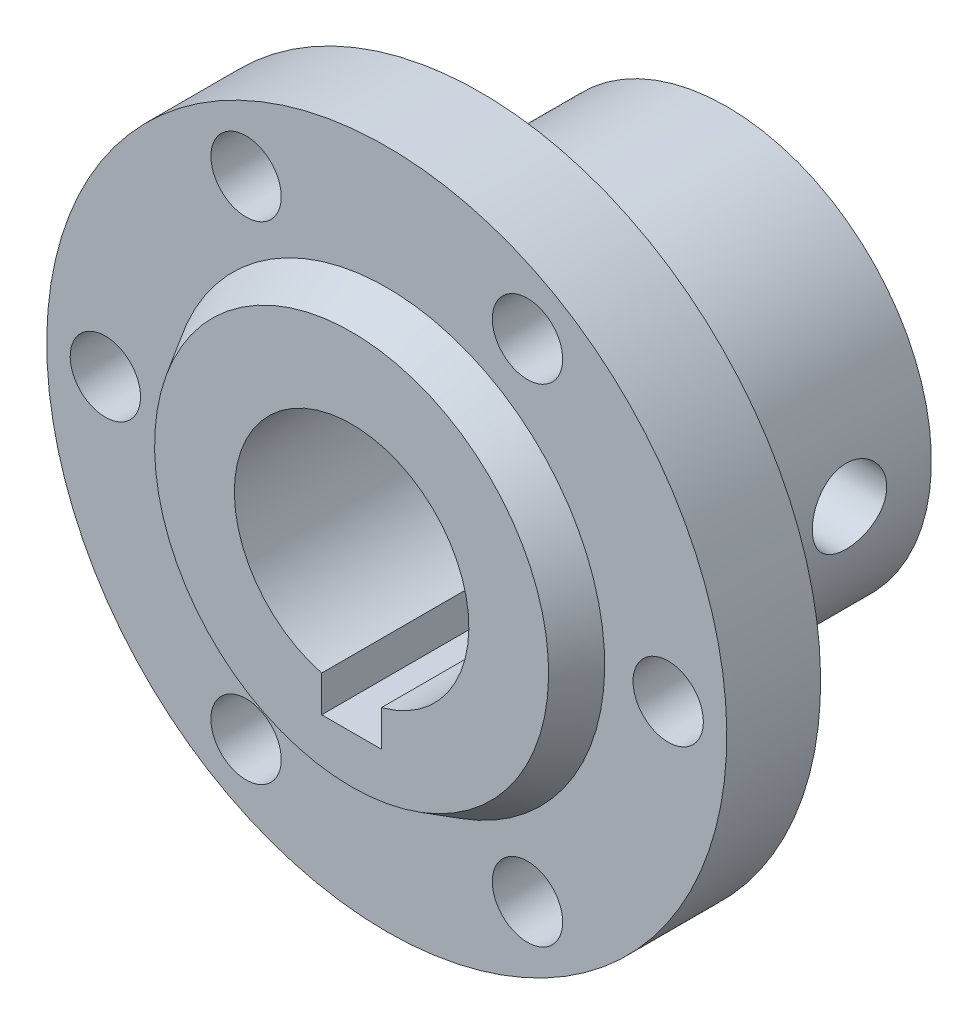
ISO-10303-21;
HEADER;
FILE_DESCRIPTION(('STEP AP214'),'2;1');
FILE_NAME('part.step','',(''),(''),'','','');
FILE_SCHEMA(('AUTOMOTIVE_DESIGN { 1 0 10303 214 1 1 1 1 }'));
ENDSEC;
DATA;
#1=APPLICATION_CONTEXT('core data for automotive mechanical design processes');
#2=APPLICATION_PROTOCOL_DEFINITION('international standard','automotive_design',2000,#1);
#3=PRODUCT_CONTEXT('',#1,'mechanical');
#4=PRODUCT('Part','Part','',(#3));
#5=PRODUCT_RELATED_PRODUCT_CATEGORY('part','',(#4));
#6=PRODUCT_DEFINITION_FORMATION('','',#4);
#7=PRODUCT_DEFINITION_CONTEXT('part definition',#1,'design');
#8=PRODUCT_DEFINITION('design','',#6,#7);
#9=PRODUCT_DEFINITION_SHAPE('','',#8);
#10=(LENGTH_UNIT() NAMED_UNIT(*) SI_UNIT(.MILLI.,.METRE.));
#11=(NAMED_UNIT(*) PLANE_ANGLE_UNIT() SI_UNIT($,.RADIAN.));
#12=(NAMED_UNIT(*) SI_UNIT($,.STERADIAN.) SOLID_ANGLE_UNIT());
#13=UNCERTAINTY_MEASURE_WITH_UNIT(LENGTH_MEASURE(1.E-05),#10,'distance_accuracy_value','');
#14=(GEOMETRIC_REPRESENTATION_CONTEXT(3) GLOBAL_UNCERTAINTY_ASSIGNED_CONTEXT((#13)) GLOBAL_UNIT_ASSIGNED_CONTEXT((#10,
#11,#12)) REPRESENTATION_CONTEXT('',''));
#15=CARTESIAN_POINT('',(0.,0.,0.));
#16=DIRECTION('',(0.,0.,1.));
#17=DIRECTION('',(1.,0.,0.));
#18=AXIS2_PLACEMENT_3D('',#15,#16,#17);
#19=CARTESIAN_POINT('',(0.,10.,-21.));
#20=DIRECTION('',(0.,0.,1.));
#21=DIRECTION('',(0.,-1.,0.));
#22=AXIS2_PLACEMENT_3D('',#19,#20,#21);
#23=PLANE('',#22);
#24=CARTESIAN_POINT('',(0.,0.,-21.));
#25=DIRECTION('',(0.,0.,1.));
#26=DIRECTION('',(0.,-1.,0.));
#27=AXIS2_PLACEMENT_3D('',#24,#25,#26);
#28=CIRCLE('',#27,17.45);
#29=CARTESIAN_POINT('',(0.,-17.45,-21.));
#30=VERTEX_POINT('',#29);
#31=EDGE_CURVE('E11',#30,#30,#28,.T.);
#32=ORIENTED_EDGE('',*,*,#31,.F.);
#33=EDGE_LOOP('',(#32));
#34=FACE_BOUND('',#33,.T.);
#35=DIRECTION('',(1.,0.,0.));
#36=VECTOR('',#35,1.);
#37=CARTESIAN_POINT('',(-2.55,-12.75,-21.));
#38=LINE('',#37,#36);
#39=CARTESIAN_POINT('',(-2.55,-12.75,-21.));
#40=VERTEX_POINT('',#39);
#41=CARTESIAN_POINT('',(2.55,-12.75,-21.));
#42=VERTEX_POINT('',#41);
#43=EDGE_CURVE('E230',#40,#42,#38,.T.);
#44=ORIENTED_EDGE('',*,*,#43,.T.);
#45=DIRECTION('',(0.,1.,0.));
#46=VECTOR('',#45,1.);
#47=CARTESIAN_POINT('',(2.55,-12.75,-21.));
#48=LINE('',#47,#46);
#49=CARTESIAN_POINT('',(2.55,-9.66941053012023,-21.));
#50=VERTEX_POINT('',#49);
#51=EDGE_CURVE('E95',#42,#50,#48,.T.);
#52=ORIENTED_EDGE('',*,*,#51,.T.);
#53=CARTESIAN_POINT('',(0.,0.,-21.));
#54=DIRECTION('',(0.,0.,1.));
#55=DIRECTION('',(0.,-1.,0.));
#56=AXIS2_PLACEMENT_3D('',#53,#54,#55);
#57=CIRCLE('',#56,10.);
#58=CARTESIAN_POINT('',(-2.55,-9.66941053012023,-21.));
#59=VERTEX_POINT('',#58);
#60=EDGE_CURVE('E109',#50,#59,#57,.T.);
#61=ORIENTED_EDGE('',*,*,#60,.T.);
#62=DIRECTION('',(0.,-1.,0.));
#63=VECTOR('',#62,1.);
#64=CARTESIAN_POINT('',(-2.55,-12.75,-21.));
#65=LINE('',#64,#63);
#66=EDGE_CURVE('E60',#59,#40,#65,.T.);
#67=ORIENTED_EDGE('',*,*,#66,.T.);
#68=EDGE_LOOP('',(#44,#52,#61,#67));
#69=FACE_BOUND('',#68,.T.);
#70=ADVANCED_FACE('F39',(#34,#69),#23,.F.);
#71=CARTESIAN_POINT('',(0.,0.,11.));
#72=DIRECTION('',(0.,0.,1.));
#73=DIRECTION('',(0.,-1.,0.));
#74=AXIS2_PLACEMENT_3D('',#71,#72,#73);
#75=CYLINDRICAL_SURFACE('',#74,17.45);
#76=CARTESIAN_POINT('',(-17.45,0.,-17.19));
#77=CARTESIAN_POINT('',(-17.4499968356423,0.176777458792748,-17.1899931464343));
#78=CARTESIAN_POINT('',(-17.4472859262513,0.35364520049326,-17.1751862053184));
#79=CARTESIAN_POINT('',(-17.4367327930988,0.702403150501791,-17.1163840413017));
#80=CARTESIAN_POINT('',(-17.4288861310247,0.874288919098851,-17.0723635716384));
#81=CARTESIAN_POINT('',(-17.4089398967288,1.20798811917376,-16.9565215224765));
#82=CARTESIAN_POINT('',(-17.3968440664669,1.36981026590932,-16.8847243984128));
#83=CARTESIAN_POINT('',(-17.3697228684474,1.67909503843731,-16.7154350646426));
#84=CARTESIAN_POINT('',(-17.3546977647874,1.82655895694355,-16.6179451710672));
#85=CARTESIAN_POINT('',(-17.3231884644956,2.10462524815861,-16.3988668251295));
#86=CARTESIAN_POINT('',(-17.3066910335339,2.23504175764802,-16.2770443437794));
#87=CARTESIAN_POINT('',(-17.2741955082971,2.47370393586634,-16.0132624520033));
#88=CARTESIAN_POINT('',(-17.2581974487005,2.58194806774579,-15.8713016468691));
#89=CARTESIAN_POINT('',(-17.2283835601209,2.7739581441263,-15.5699694243305));
#90=CARTESIAN_POINT('',(-17.2145848068104,2.85753647155956,-15.4104766187937));
#91=CARTESIAN_POINT('',(-17.1909176189237,2.99664176919229,-15.0794211690432));
#92=CARTESIAN_POINT('',(-17.1810488660407,3.05217101129911,-14.9078595036604));
#93=CARTESIAN_POINT('',(-17.1664918922464,3.13300834630634,-14.5595201169512));
#94=CARTESIAN_POINT('',(-17.1617482989302,3.15863970284213,-14.382819773011));
#95=CARTESIAN_POINT('',(-17.1578116456317,3.17995677493461,-14.0275677830454));
#96=CARTESIAN_POINT('',(-17.1586181172308,3.175645017653,-13.8490162945243));
#97=CARTESIAN_POINT('',(-17.1656400178698,3.1374607089361,-13.4974628251121));
#98=CARTESIAN_POINT('',(-17.1717884116802,3.10395450081108,-13.3244195175767));
#99=CARTESIAN_POINT('',(-17.1886961965339,3.00890878421799,-12.9864520815007));
#100=CARTESIAN_POINT('',(-17.1994557731118,2.9473681477562,-12.8215282799527));
#101=CARTESIAN_POINT('',(-17.2244443173296,2.79763858959231,-12.5034026629164));
#102=CARTESIAN_POINT('',(-17.2386926064282,2.70930058220796,-12.3502725966404));
#103=CARTESIAN_POINT('',(-17.2690402067667,2.5085894229184,-12.0608706922427));
#104=CARTESIAN_POINT('',(-17.2851396951733,2.39621396965536,-11.9246004702645));
#105=CARTESIAN_POINT('',(-17.3176684711285,2.14863688732397,-11.6706687162038));
#106=CARTESIAN_POINT('',(-17.3340991101936,2.01312163743453,-11.5533129153884));
#107=CARTESIAN_POINT('',(-17.3652192399338,1.72416428234283,-11.3429560871944));
#108=CARTESIAN_POINT('',(-17.3799087150282,1.57072201674669,-11.2499552777452));
#109=CARTESIAN_POINT('',(-17.4059184967845,1.2499561199525,-11.0909081550799));
#110=CARTESIAN_POINT('',(-17.4172349914246,1.08261705402134,-11.0248923082548));
#111=CARTESIAN_POINT('',(-17.4351940146049,0.738973567082016,-10.9219910883415));
#112=CARTESIAN_POINT('',(-17.4418370102476,0.562670043934365,-10.8851028039935));
#113=CARTESIAN_POINT('',(-17.4496367647488,0.208733888507845,-10.8419262958792));
#114=CARTESIAN_POINT('',(-17.4508686610799,0.0311539853256341,-10.8352189532137));
#115=CARTESIAN_POINT('',(-17.4479144808514,-0.322590449564425,-10.8514723843021));
#116=CARTESIAN_POINT('',(-17.4437286543511,-0.498755046219249,-10.8744317887639));
#117=CARTESIAN_POINT('',(-17.4304560591178,-0.843348466341477,-10.9490184643946));
#118=CARTESIAN_POINT('',(-17.4214053429004,-1.01182442783343,-11.0004349293327));
#119=CARTESIAN_POINT('',(-17.3994135712492,-1.33776493136578,-11.1302490218501));
#120=CARTESIAN_POINT('',(-17.3864722638838,-1.49522875951145,-11.2086483967307));
#121=CARTESIAN_POINT('',(-17.357947493001,-1.79647274188855,-11.3911394037856));
#122=CARTESIAN_POINT('',(-17.3423380528372,-1.94009428345074,-11.4954887211316));
#123=CARTESIAN_POINT('',(-17.3102783837538,-2.20793827608375,-11.7265672394738));
#124=CARTESIAN_POINT('',(-17.2938280812997,-2.33215902666324,-11.8532984001802));
#125=CARTESIAN_POINT('',(-17.2616932015934,-2.55925710014975,-12.1274358611325));
#126=CARTESIAN_POINT('',(-17.2460207208549,-2.66184916434728,-12.2750801228644));
#127=CARTESIAN_POINT('',(-17.2174544192312,-2.84077578169373,-12.5857529986813));
#128=CARTESIAN_POINT('',(-17.2045604989398,-2.91711127425871,-12.7487810620936));
#129=CARTESIAN_POINT('',(-17.1831050058779,-3.04094721478348,-13.0848492555839));
#130=CARTESIAN_POINT('',(-17.1745233533884,-3.08858151797524,-13.2578387207718));
#131=CARTESIAN_POINT('',(-17.162616875861,-3.15407824872835,-13.6095353554068));
#132=CARTESIAN_POINT('',(-17.1592914961203,-3.17194381784172,-13.7882419194885));
#133=CARTESIAN_POINT('',(-17.1583010557209,-3.17729563175429,-14.1434451641146));
#134=CARTESIAN_POINT('',(-17.1605522100864,-3.16523155229777,-14.319934993724));
#135=CARTESIAN_POINT('',(-17.1702760049224,-3.11204764664827,-14.668326900801));
#136=CARTESIAN_POINT('',(-17.1777486184265,-3.07092797051382,-14.8402290019571));
#137=CARTESIAN_POINT('',(-17.1970390158291,-2.96098509209594,-15.1743427087057));
#138=CARTESIAN_POINT('',(-17.2088495914337,-2.89220782992035,-15.3365698740631));
#139=CARTESIAN_POINT('',(-17.2354907323,-2.7289503868357,-15.6472548165606));
#140=CARTESIAN_POINT('',(-17.2503214935714,-2.63446853756776,-15.7957116991001));
#141=CARTESIAN_POINT('',(-17.2815935905806,-2.42090899485702,-16.0768999281954));
#142=CARTESIAN_POINT('',(-17.2980547013253,-2.30150301885964,-16.2093797892677));
#143=CARTESIAN_POINT('',(-17.3305821444212,-2.04217171451801,-16.452573342114));
#144=CARTESIAN_POINT('',(-17.3466483851531,-1.90224167560724,-16.5632820233998));
#145=CARTESIAN_POINT('',(-17.3767337881174,-1.60442792144329,-16.7606551385875));
#146=CARTESIAN_POINT('',(-17.3907346111634,-1.44640320080985,-16.8471096763676));
#147=CARTESIAN_POINT('',(-17.4149329322382,-1.11787195477031,-16.9921065373913));
#148=CARTESIAN_POINT('',(-17.4251340609271,-0.947377531706018,-17.0506755206348));
#149=CARTESIAN_POINT('',(-17.4384628809173,-0.646945957537485,-17.1261171294365));
#150=CARTESIAN_POINT('',(-17.4427652348522,-0.518783165569404,-17.1500329913935));
#151=CARTESIAN_POINT('',(-17.4485349275157,-0.260429886193315,-17.181976768993));
#152=CARTESIAN_POINT('',(-17.4500023313164,-0.130239445396246,-17.1900050493123));
#153=CARTESIAN_POINT('',(-17.45,0.,-17.19));
#154=B_SPLINE_CURVE_WITH_KNOTS('',3,(#76,#77,#78,#79,#80,#81,#82,#83,#84,#85,#86,#87,#88,#89,
#90,#91,#92,#93,#94,#95,#96,#97,#98,#99,#100,#101,#102,#103,#104,#105,#106,#107,#108,#109,#110,
#111,#112,#113,#114,#115,#116,#117,#118,#119,#120,#121,#122,#123,#124,#125,#126,#127,#128,#129,
#130,#131,#132,#133,#134,#135,#136,#137,#138,#139,#140,#141,#142,#143,#144,#145,#146,#147,#148,
#149,#150,#151,#152,#153),.UNSPECIFIED.,.T.,.F.,(4,2,2,2,2,2,2,2,2,2,2,2,2,2,2,2,2,2,2,2,2,2,2,
2,2,2,2,2,2,2,2,2,2,2,2,2,2,2,4),(0.,0.529856147897096,1.06017080264573,1.59001961046401,
2.11982067022852,2.65498657198904,3.19018955553412,3.7293643481414,4.2684954619029,
4.80174167350453,5.33494288033355,5.86154809141934,6.38817449287283,6.91778622411281,
7.44744868337449,7.98496123437811,8.52247859490127,9.06060115475076,9.59866992317804,
10.1292430654468,10.6597917195671,11.186461747219,11.7131658862526,12.2453251036395,
12.7775309389651,13.3163688022479,13.8551873848102,14.3914731986041,14.9277024135346,
15.4559240238528,15.9841429061742,16.5114880009291,17.0388673312407,17.5736890849395,
18.1086337805306,18.6480743417554,19.1869981297487,19.5773745688751,19.9677420473601),.UNSPECIFIED.);
#155=CARTESIAN_POINT('',(-17.45,0.,-17.19));
#156=VERTEX_POINT('',#155);
#157=EDGE_CURVE('E136',#156,#156,#154,.T.);
#158=ORIENTED_EDGE('',*,*,#157,.T.);
#159=EDGE_LOOP('',(#158));
#160=FACE_BOUND('',#159,.T.);
#161=CARTESIAN_POINT('',(17.45,0.,-17.19));
#162=CARTESIAN_POINT('',(17.4499968356423,-0.176777458792748,-17.1899931464343));
#163=CARTESIAN_POINT('',(17.4472859262513,-0.35364520049326,-17.1751862053184));
#164=CARTESIAN_POINT('',(17.4367327930988,-0.702403150501791,-17.1163840413017));
#165=CARTESIAN_POINT('',(17.4288861310247,-0.874288919098851,-17.0723635716384));
#166=CARTESIAN_POINT('',(17.4089398967288,-1.20798811917376,-16.9565215224765));
#167=CARTESIAN_POINT('',(17.3968440664669,-1.36981026590932,-16.8847243984128));
#168=CARTESIAN_POINT('',(17.3697228684474,-1.67909503843731,-16.7154350646426));
#169=CARTESIAN_POINT('',(17.3546977647874,-1.82655895694355,-16.6179451710672));
#170=CARTESIAN_POINT('',(17.3231884644956,-2.10462524815862,-16.3988668251295));
#171=CARTESIAN_POINT('',(17.3066910335339,-2.23504175764802,-16.2770443437794));
#172=CARTESIAN_POINT('',(17.2741955082971,-2.47370393586634,-16.0132624520033));
#173=CARTESIAN_POINT('',(17.2581974487005,-2.58194806774579,-15.8713016468691));
#174=CARTESIAN_POINT('',(17.2283835601209,-2.7739581441263,-15.5699694243305));
#175=CARTESIAN_POINT('',(17.2145848068104,-2.85753647155956,-15.4104766187937));
#176=CARTESIAN_POINT('',(17.1909176189237,-2.99664176919229,-15.0794211690432));
#177=CARTESIAN_POINT('',(17.1810488660407,-3.05217101129911,-14.9078595036604));
#178=CARTESIAN_POINT('',(17.1664918922464,-3.13300834630634,-14.5595201169512));
#179=CARTESIAN_POINT('',(17.1617482989302,-3.15863970284213,-14.382819773011));
#180=CARTESIAN_POINT('',(17.1578116456317,-3.17995677493461,-14.0275677830454));
#181=CARTESIAN_POINT('',(17.1586181172308,-3.175645017653,-13.8490162945243));
#182=CARTESIAN_POINT('',(17.1656400178698,-3.1374607089361,-13.4974628251121));
#183=CARTESIAN_POINT('',(17.1717884116802,-3.10395450081108,-13.3244195175766));
#184=CARTESIAN_POINT('',(17.1886961965339,-3.00890878421799,-12.9864520815007));
#185=CARTESIAN_POINT('',(17.1994557731118,-2.9473681477562,-12.8215282799527));
#186=CARTESIAN_POINT('',(17.2244443173296,-2.79763858959231,-12.5034026629164));
#187=CARTESIAN_POINT('',(17.2386926064282,-2.70930058220796,-12.3502725966404));
#188=CARTESIAN_POINT('',(17.2690402067667,-2.5085894229184,-12.0608706922427));
#189=CARTESIAN_POINT('',(17.2851396951733,-2.39621396965536,-11.9246004702645));
#190=CARTESIAN_POINT('',(17.3176684711285,-2.14863688732397,-11.6706687162038));
#191=CARTESIAN_POINT('',(17.3340991101936,-2.01312163743453,-11.5533129153884));
#192=CARTESIAN_POINT('',(17.3652192399338,-1.72416428234283,-11.3429560871944));
#193=CARTESIAN_POINT('',(17.3799087150282,-1.57072201674669,-11.2499552777452));
#194=CARTESIAN_POINT('',(17.4059184967845,-1.2499561199525,-11.0909081550799));
#195=CARTESIAN_POINT('',(17.4172349914246,-1.08261705402134,-11.0248923082548));
#196=CARTESIAN_POINT('',(17.4351940146049,-0.738973567082019,-10.9219910883415));
#197=CARTESIAN_POINT('',(17.4418370102476,-0.562670043934368,-10.8851028039935));
#198=CARTESIAN_POINT('',(17.4496367647488,-0.208733888507847,-10.8419262958792));
#199=CARTESIAN_POINT('',(17.4508686610799,-0.0311539853256363,-10.8352189532137));
#200=CARTESIAN_POINT('',(17.4479144808514,0.322590449564423,-10.8514723843021));
#201=CARTESIAN_POINT('',(17.4437286543511,0.498755046219247,-10.8744317887639));
#202=CARTESIAN_POINT('',(17.4304560591178,0.843348466341475,-10.9490184643946));
#203=CARTESIAN_POINT('',(17.4214053429004,1.01182442783343,-11.0004349293327));
#204=CARTESIAN_POINT('',(17.3994135712492,1.33776493136578,-11.1302490218501));
#205=CARTESIAN_POINT('',(17.3864722638838,1.49522875951145,-11.2086483967307));
#206=CARTESIAN_POINT('',(17.357947493001,1.79647274188855,-11.3911394037856));
#207=CARTESIAN_POINT('',(17.3423380528372,1.94009428345074,-11.4954887211316));
#208=CARTESIAN_POINT('',(17.3102783837538,2.20793827608375,-11.7265672394738));
#209=CARTESIAN_POINT('',(17.2938280812997,2.33215902666324,-11.8532984001802));
#210=CARTESIAN_POINT('',(17.2616932015934,2.55925710014975,-12.1274358611325));
#211=CARTESIAN_POINT('',(17.2460207208549,2.66184916434728,-12.2750801228644));
#212=CARTESIAN_POINT('',(17.2174544192312,2.84077578169373,-12.5857529986813));
#213=CARTESIAN_POINT('',(17.2045604989398,2.91711127425872,-12.7487810620936));
#214=CARTESIAN_POINT('',(17.1831050058779,3.04094721478348,-13.0848492555839));
#215=CARTESIAN_POINT('',(17.1745233533884,3.08858151797524,-13.2578387207718));
#216=CARTESIAN_POINT('',(17.162616875861,3.15407824872835,-13.6095353554068));
#217=CARTESIAN_POINT('',(17.1592914961203,3.17194381784172,-13.7882419194885));
#218=CARTESIAN_POINT('',(17.1583010557209,3.17729563175429,-14.1434451641146));
#219=CARTESIAN_POINT('',(17.1605522100864,3.16523155229777,-14.319934993724));
#220=CARTESIAN_POINT('',(17.1702760049224,3.11204764664827,-14.668326900801));
#221=CARTESIAN_POINT('',(17.1777486184265,3.07092797051382,-14.8402290019571));
#222=CARTESIAN_POINT('',(17.1970390158291,2.96098509209594,-15.1743427087057));
#223=CARTESIAN_POINT('',(17.2088495914337,2.89220782992035,-15.3365698740631));
#224=CARTESIAN_POINT('',(17.2354907323,2.7289503868357,-15.6472548165606));
#225=CARTESIAN_POINT('',(17.2503214935714,2.63446853756776,-15.7957116991001));
#226=CARTESIAN_POINT('',(17.2815935905806,2.42090899485702,-16.0768999281954));
#227=CARTESIAN_POINT('',(17.2980547013253,2.30150301885964,-16.2093797892677));
#228=CARTESIAN_POINT('',(17.3305821444212,2.04217171451801,-16.452573342114));
#229=CARTESIAN_POINT('',(17.3466483851531,1.90224167560724,-16.5632820233998));
#230=CARTESIAN_POINT('',(17.3767337881174,1.60442792144329,-16.7606551385875));
#231=CARTESIAN_POINT('',(17.3907346111634,1.44640320080985,-16.8471096763676));
#232=CARTESIAN_POINT('',(17.4149329322382,1.11787195477032,-16.9921065373913));
#233=CARTESIAN_POINT('',(17.4251340609271,0.947377531706022,-17.0506755206347));
#234=CARTESIAN_POINT('',(17.4384628809173,0.646945957537488,-17.1261171294365));
#235=CARTESIAN_POINT('',(17.4427652348522,0.518783165569407,-17.1500329913935));
#236=CARTESIAN_POINT('',(17.4485349275157,0.260429886193316,-17.181976768993));
#237=CARTESIAN_POINT('',(17.4500023313164,0.130239445396246,-17.1900050493123));
#238=CARTESIAN_POINT('',(17.45,0.,-17.19));
#239=B_SPLINE_CURVE_WITH_KNOTS('',3,(#161,#162,#163,#164,#165,#166,#167,#168,#169,#170,#171,
#172,#173,#174,#175,#176,#177,#178,#179,#180,#181,#182,#183,#184,#185,#186,#187,#188,#189,#190,
#191,#192,#193,#194,#195,#196,#197,#198,#199,#200,#201,#202,#203,#204,#205,#206,#207,#208,#209,
#210,#211,#212,#213,#214,#215,#216,#217,#218,#219,#220,#221,#222,#223,#224,#225,#226,#227,#228,
#229,#230,#231,#232,#233,#234,#235,#236,#237,#238),.UNSPECIFIED.,.T.,.F.,(4,2,2,2,2,2,2,2,2,2,2,
2,2,2,2,2,2,2,2,2,2,2,2,2,2,2,2,2,2,2,2,2,2,2,2,2,2,2,4),(0.,0.529856147897096,1.06017080264573,
1.59001961046401,2.11982067022852,2.65498657198904,3.19018955553413,3.7293643481414,
4.26849546190291,4.80174167350453,5.33494288033355,5.86154809141934,6.38817449287283,
6.91778622411281,7.44744868337449,7.9849612343781,8.52247859490127,9.06060115475075,
9.59866992317803,10.1292430654468,10.6597917195671,11.186461747219,11.7131658862526,
12.2453251036395,12.7775309389651,13.3163688022479,13.8551873848102,14.3914731986041,
14.9277024135346,15.4559240238528,15.9841429061742,16.5114880009291,17.0388673312407,
17.5736890849395,18.1086337805306,18.6480743417554,19.1869981297487,19.5773745688751,
19.9677420473601),.UNSPECIFIED.);
#240=CARTESIAN_POINT('',(17.45,0.,-17.19));
#241=VERTEX_POINT('',#240);
#242=EDGE_CURVE('E176',#241,#241,#239,.T.);
#243=ORIENTED_EDGE('',*,*,#242,.T.);
#244=EDGE_LOOP('',(#243));
#245=FACE_BOUND('',#244,.T.);
#246=CARTESIAN_POINT('',(0.,0.,-7.03));
#247=DIRECTION('',(0.,0.,1.));
#248=DIRECTION('',(0.,-1.,0.));
#249=AXIS2_PLACEMENT_3D('',#246,#247,#248);
#250=CIRCLE('',#249,17.45);
#251=CARTESIAN_POINT('',(0.,-17.45,-7.03));
#252=VERTEX_POINT('',#251);
#253=EDGE_CURVE('E52',#252,#252,#250,.T.);
#254=ORIENTED_EDGE('',*,*,#253,.F.);
#255=EDGE_LOOP('',(#254));
#256=FACE_BOUND('',#255,.T.);
#257=ORIENTED_EDGE('',*,*,#31,.T.);
#258=EDGE_LOOP('',(#257));
#259=FACE_BOUND('',#258,.T.);
#260=ADVANCED_FACE('F185',(#160,#245,#256,#259),#75,.T.);
#261=CARTESIAN_POINT('',(0.,17.45,-7.03));
#262=DIRECTION('',(0.,0.,1.));
#263=DIRECTION('',(0.,-1.,0.));
#264=AXIS2_PLACEMENT_3D('',#261,#262,#263);
#265=PLANE('',#264);
#266=CARTESIAN_POINT('',(0.,0.,-7.03));
#267=DIRECTION('',(0.,0.,1.));
#268=DIRECTION('',(0.,-1.,0.));
#269=AXIS2_PLACEMENT_3D('',#266,#267,#268);
#270=CIRCLE('',#269,18.5);
#271=CARTESIAN_POINT('',(0.,-18.5,-7.03));
#272=VERTEX_POINT('',#271);
#273=EDGE_CURVE('E127',#272,#272,#270,.T.);
#274=ORIENTED_EDGE('',*,*,#273,.F.);
#275=EDGE_LOOP('',(#274));
#276=FACE_BOUND('',#275,.T.);
#277=ORIENTED_EDGE('',*,*,#253,.T.);
#278=EDGE_LOOP('',(#277));
#279=FACE_BOUND('',#278,.T.);
#280=ADVANCED_FACE('F189',(#276,#279),#265,.F.);
#281=CARTESIAN_POINT('',(0.,0.,11.));
#282=DIRECTION('',(0.,0.,1.));
#283=DIRECTION('',(0.,-1.,0.));
#284=AXIS2_PLACEMENT_3D('',#281,#282,#283);
#285=CYLINDRICAL_SURFACE('',#284,18.5);
#286=CARTESIAN_POINT('',(0.,0.,0.));
#287=DIRECTION('',(0.,0.,1.));
#288=DIRECTION('',(0.,-1.,0.));
#289=AXIS2_PLACEMENT_3D('',#286,#287,#288);
#290=CIRCLE('',#289,18.5);
#291=CARTESIAN_POINT('',(0.,-18.5,0.));
#292=VERTEX_POINT('',#291);
#293=EDGE_CURVE('E124',#292,#292,#290,.T.);
#294=ORIENTED_EDGE('',*,*,#293,.F.);
#295=EDGE_LOOP('',(#294));
#296=FACE_BOUND('',#295,.T.);
#297=ORIENTED_EDGE('',*,*,#273,.T.);
#298=EDGE_LOOP('',(#297));
#299=FACE_BOUND('',#298,.T.);
#300=ADVANCED_FACE('F194',(#296,#299),#285,.T.);
#301=CARTESIAN_POINT('',(0.,18.5,0.));
#302=DIRECTION('',(0.,0.,1.));
#303=DIRECTION('',(0.,-1.,0.));
#304=AXIS2_PLACEMENT_3D('',#301,#302,#303);
#305=PLANE('',#304);
#306=CARTESIAN_POINT('',(24.,0.,0.));
#307=DIRECTION('',(0.,0.,1.));
#308=DIRECTION('',(0.,-1.,0.));
#309=AXIS2_PLACEMENT_3D('',#306,#307,#308);
#310=CIRCLE('',#309,2.99999999999999);
#311=CARTESIAN_POINT('',(24.,-2.99999999999999,0.));
#312=VERTEX_POINT('',#311);
#313=EDGE_CURVE('E105',#312,#312,#310,.T.);
#314=ORIENTED_EDGE('',*,*,#313,.T.);
#315=EDGE_LOOP('',(#314));
#316=FACE_BOUND('',#315,.T.);
#317=CARTESIAN_POINT('',(12.,-20.7846096908265,0.));
#318=DIRECTION('',(0.,0.,1.));
#319=DIRECTION('',(0.,-1.,0.));
#320=AXIS2_PLACEMENT_3D('',#317,#318,#319);
#321=CIRCLE('',#320,3.00000000000001);
#322=CARTESIAN_POINT('',(12.,-23.7846096908265,0.));
#323=VERTEX_POINT('',#322);
#324=EDGE_CURVE('E152',#323,#323,#321,.T.);
#325=ORIENTED_EDGE('',*,*,#324,.T.);
#326=EDGE_LOOP('',(#325));
#327=FACE_BOUND('',#326,.T.);
#328=CARTESIAN_POINT('',(-12.,-20.7846096908265,0.));
#329=DIRECTION('',(0.,0.,1.));
#330=DIRECTION('',(0.,-1.,0.));
#331=AXIS2_PLACEMENT_3D('',#328,#329,#330);
#332=CIRCLE('',#331,3.00000000000001);
#333=CARTESIAN_POINT('',(-12.,-23.7846096908265,0.));
#334=VERTEX_POINT('',#333);
#335=EDGE_CURVE('E148',#334,#334,#332,.T.);
#336=ORIENTED_EDGE('',*,*,#335,.T.);
#337=EDGE_LOOP('',(#336));
#338=FACE_BOUND('',#337,.T.);
#339=CARTESIAN_POINT('',(-24.,0.,0.));
#340=DIRECTION('',(0.,0.,1.));
#341=DIRECTION('',(0.,-1.,0.));
#342=AXIS2_PLACEMENT_3D('',#339,#340,#341);
#343=CIRCLE('',#342,2.99999999999999);
#344=CARTESIAN_POINT('',(-24.,-2.99999999999999,0.));
#345=VERTEX_POINT('',#344);
#346=EDGE_CURVE('E144',#345,#345,#343,.T.);
#347=ORIENTED_EDGE('',*,*,#346,.T.);
#348=EDGE_LOOP('',(#347));
#349=FACE_BOUND('',#348,.T.);
#350=CARTESIAN_POINT('',(-12.,20.7846096908265,0.));
#351=DIRECTION('',(0.,0.,1.));
#352=DIRECTION('',(0.,-1.,0.));
#353=AXIS2_PLACEMENT_3D('',#350,#351,#352);
#354=CIRCLE('',#353,3.00000000000001);
#355=CARTESIAN_POINT('',(-12.,17.7846096908265,0.));
#356=VERTEX_POINT('',#355);
#357=EDGE_CURVE('E140',#356,#356,#354,.T.);
#358=ORIENTED_EDGE('',*,*,#357,.T.);
#359=EDGE_LOOP('',(#358));
#360=FACE_BOUND('',#359,.T.);
#361=CARTESIAN_POINT('',(12.,20.7846096908265,0.));
#362=DIRECTION('',(0.,0.,1.));
#363=DIRECTION('',(0.,-1.,0.));
#364=AXIS2_PLACEMENT_3D('',#361,#362,#363);
#365=CIRCLE('',#364,3.00000000000001);
#366=CARTESIAN_POINT('',(12.,17.7846096908265,0.));
#367=VERTEX_POINT('',#366);
#368=EDGE_CURVE('E135',#367,#367,#365,.T.);
#369=ORIENTED_EDGE('',*,*,#368,.T.);
#370=EDGE_LOOP('',(#369));
#371=FACE_BOUND('',#370,.T.);
#372=CARTESIAN_POINT('',(0.,0.,0.));
#373=DIRECTION('',(0.,0.,1.));
#374=DIRECTION('',(0.,-1.,0.));
#375=AXIS2_PLACEMENT_3D('',#372,#373,#374);
#376=CIRCLE('',#375,29.);
#377=CARTESIAN_POINT('',(0.,-29.,0.));
#378=VERTEX_POINT('',#377);
#379=EDGE_CURVE('E121',#378,#378,#376,.T.);
#380=ORIENTED_EDGE('',*,*,#379,.F.);
#381=EDGE_LOOP('',(#380));
#382=FACE_BOUND('',#381,.T.);
#383=ORIENTED_EDGE('',*,*,#293,.T.);
#384=EDGE_LOOP('',(#383));
#385=FACE_BOUND('',#384,.T.);
#386=ADVANCED_FACE('F198',(#316,#327,#338,#349,#360,#371,#382,#385),#305,.F.);
#387=CARTESIAN_POINT('',(0.,0.,11.));
#388=DIRECTION('',(0.,0.,1.));
#389=DIRECTION('',(0.,-1.,0.));
#390=AXIS2_PLACEMENT_3D('',#387,#388,#389);
#391=CYLINDRICAL_SURFACE('',#390,29.);
#392=CARTESIAN_POINT('',(0.,0.,8.));
#393=DIRECTION('',(0.,0.,1.));
#394=DIRECTION('',(0.,-1.,0.));
#395=AXIS2_PLACEMENT_3D('',#392,#393,#394);
#396=CIRCLE('',#395,29.);
#397=CARTESIAN_POINT('',(0.,-29.,8.00000000000001));
#398=VERTEX_POINT('',#397);
#399=EDGE_CURVE('E118',#398,#398,#396,.T.);
#400=ORIENTED_EDGE('',*,*,#399,.F.);
#401=EDGE_LOOP('',(#400));
#402=FACE_BOUND('',#401,.T.);
#403=ORIENTED_EDGE('',*,*,#379,.T.);
#404=EDGE_LOOP('',(#403));
#405=FACE_BOUND('',#404,.T.);
#406=ADVANCED_FACE('F202',(#402,#405),#391,.T.);
#407=CARTESIAN_POINT('',(0.,29.,8.));
#408=DIRECTION('',(0.,0.,-1.));
#409=DIRECTION('',(0.,1.,0.));
#410=AXIS2_PLACEMENT_3D('',#407,#408,#409);
#411=PLANE('',#410);
#412=CARTESIAN_POINT('',(24.,0.,8.));
#413=DIRECTION('',(0.,0.,-1.));
#414=DIRECTION('',(0.,1.,0.));
#415=AXIS2_PLACEMENT_3D('',#412,#413,#414);
#416=CIRCLE('',#415,2.99999999999999);
#417=CARTESIAN_POINT('',(24.,2.99999999999999,8.));
#418=VERTEX_POINT('',#417);
#419=EDGE_CURVE('E153',#418,#418,#416,.T.);
#420=ORIENTED_EDGE('',*,*,#419,.T.);
#421=EDGE_LOOP('',(#420));
#422=FACE_BOUND('',#421,.T.);
#423=CARTESIAN_POINT('',(12.,-20.7846096908265,8.));
#424=DIRECTION('',(0.,0.,-1.));
#425=DIRECTION('',(0.,1.,0.));
#426=AXIS2_PLACEMENT_3D('',#423,#424,#425);
#427=CIRCLE('',#426,3.00000000000001);
#428=CARTESIAN_POINT('',(12.,-17.7846096908265,8.));
#429=VERTEX_POINT('',#428);
#430=EDGE_CURVE('E149',#429,#429,#427,.T.);
#431=ORIENTED_EDGE('',*,*,#430,.T.);
#432=EDGE_LOOP('',(#431));
#433=FACE_BOUND('',#432,.T.);
#434=CARTESIAN_POINT('',(-12.,-20.7846096908265,8.));
#435=DIRECTION('',(0.,0.,-1.));
#436=DIRECTION('',(0.,1.,0.));
#437=AXIS2_PLACEMENT_3D('',#434,#435,#436);
#438=CIRCLE('',#437,3.00000000000001);
#439=CARTESIAN_POINT('',(-12.,-17.7846096908265,8.));
#440=VERTEX_POINT('',#439);
#441=EDGE_CURVE('E145',#440,#440,#438,.T.);
#442=ORIENTED_EDGE('',*,*,#441,.T.);
#443=EDGE_LOOP('',(#442));
#444=FACE_BOUND('',#443,.T.);
#445=CARTESIAN_POINT('',(-24.,0.,8.));
#446=DIRECTION('',(0.,0.,-1.));
#447=DIRECTION('',(0.,1.,0.));
#448=AXIS2_PLACEMENT_3D('',#445,#446,#447);
#449=CIRCLE('',#448,2.99999999999999);
#450=CARTESIAN_POINT('',(-24.,3.,8.));
#451=VERTEX_POINT('',#450);
#452=EDGE_CURVE('E141',#451,#451,#449,.T.);
#453=ORIENTED_EDGE('',*,*,#452,.T.);
#454=EDGE_LOOP('',(#453));
#455=FACE_BOUND('',#454,.T.);
#456=CARTESIAN_POINT('',(-12.,20.7846096908265,8.));
#457=DIRECTION('',(0.,0.,-1.));
#458=DIRECTION('',(0.,1.,0.));
#459=AXIS2_PLACEMENT_3D('',#456,#457,#458);
#460=CIRCLE('',#459,3.00000000000001);
#461=CARTESIAN_POINT('',(-12.,23.7846096908265,8.));
#462=VERTEX_POINT('',#461);
#463=EDGE_CURVE('E137',#462,#462,#460,.T.);
#464=ORIENTED_EDGE('',*,*,#463,.T.);
#465=EDGE_LOOP('',(#464));
#466=FACE_BOUND('',#465,.T.);
#467=CARTESIAN_POINT('',(12.,20.7846096908265,8.));
#468=DIRECTION('',(0.,0.,-1.));
#469=DIRECTION('',(0.,1.,0.));
#470=AXIS2_PLACEMENT_3D('',#467,#468,#469);
#471=CIRCLE('',#470,3.00000000000001);
#472=CARTESIAN_POINT('',(12.,23.7846096908265,8.));
#473=VERTEX_POINT('',#472);
#474=EDGE_CURVE('E132',#473,#473,#471,.T.);
#475=ORIENTED_EDGE('',*,*,#474,.T.);
#476=EDGE_LOOP('',(#475));
#477=FACE_BOUND('',#476,.T.);
#478=CARTESIAN_POINT('',(0.,0.,8.));
#479=DIRECTION('',(0.,0.,1.));
#480=DIRECTION('',(0.,-1.,0.));
#481=AXIS2_PLACEMENT_3D('',#478,#479,#480);
#482=CIRCLE('',#481,18.5862350540226);
#483=CARTESIAN_POINT('',(0.,-18.5862350540226,8.));
#484=VERTEX_POINT('',#483);
#485=EDGE_CURVE('E112',#484,#484,#482,.T.);
#486=ORIENTED_EDGE('',*,*,#485,.F.);
#487=EDGE_LOOP('',(#486));
#488=FACE_BOUND('',#487,.T.);
#489=ORIENTED_EDGE('',*,*,#399,.T.);
#490=EDGE_LOOP('',(#489));
#491=FACE_BOUND('',#490,.T.);
#492=ADVANCED_FACE('F206',(#422,#433,#444,#455,#466,#477,#488,#491),#411,.F.);
#493=CARTESIAN_POINT('',(0.,0.,8.));
#494=DIRECTION('',(0.,0.,-1.));
#495=DIRECTION('',(0.,1.,0.));
#496=AXIS2_PLACEMENT_3D('',#493,#494,#495);
#497=CONICAL_SURFACE('',#496,18.5862350540226,0.536247023308468);
#498=CARTESIAN_POINT('',(0.,0.,11.));
#499=DIRECTION('',(0.,0.,1.));
#500=DIRECTION('',(0.,-1.,0.));
#501=AXIS2_PLACEMENT_3D('',#498,#499,#500);
#502=CIRCLE('',#501,16.8032163461437);
#503=CARTESIAN_POINT('',(0.,-16.8032163461437,11.));
#504=VERTEX_POINT('',#503);
#505=EDGE_CURVE('E108',#504,#504,#502,.T.);
#506=ORIENTED_EDGE('',*,*,#505,.F.);
#507=EDGE_LOOP('',(#506));
#508=FACE_BOUND('',#507,.T.);
#509=ORIENTED_EDGE('',*,*,#485,.T.);
#510=EDGE_LOOP('',(#509));
#511=FACE_BOUND('',#510,.T.);
#512=ADVANCED_FACE('F210',(#508,#511),#497,.T.);
#513=CARTESIAN_POINT('',(0.,10.,11.));
#514=DIRECTION('',(0.,0.,-1.));
#515=DIRECTION('',(0.,1.,0.));
#516=AXIS2_PLACEMENT_3D('',#513,#514,#515);
#517=PLANE('',#516);
#518=CARTESIAN_POINT('',(0.,0.,11.));
#519=DIRECTION('',(0.,0.,1.));
#520=DIRECTION('',(0.,-1.,0.));
#521=AXIS2_PLACEMENT_3D('',#518,#519,#520);
#522=CIRCLE('',#521,10.);
#523=CARTESIAN_POINT('',(2.55,-9.66941053012023,11.));
#524=VERTEX_POINT('',#523);
#525=CARTESIAN_POINT('',(-2.55,-9.66941053012023,11.));
#526=VERTEX_POINT('',#525);
#527=EDGE_CURVE('E102',#524,#526,#522,.T.);
#528=ORIENTED_EDGE('',*,*,#527,.F.);
#529=DIRECTION('',(0.,1.,0.));
#530=VECTOR('',#529,1.);
#531=CARTESIAN_POINT('',(2.55,-12.75,11.));
#532=LINE('',#531,#530);
#533=CARTESIAN_POINT('',(2.55,-12.75,11.));
#534=VERTEX_POINT('',#533);
#535=EDGE_CURVE('E234',#534,#524,#532,.T.);
#536=ORIENTED_EDGE('',*,*,#535,.F.);
#537=DIRECTION('',(1.,0.,0.));
#538=VECTOR('',#537,1.);
#539=CARTESIAN_POINT('',(-2.55,-12.75,11.));
#540=LINE('',#539,#538);
#541=CARTESIAN_POINT('',(-2.55,-12.75,11.));
#542=VERTEX_POINT('',#541);
#543=EDGE_CURVE('E104',#542,#534,#540,.T.);
#544=ORIENTED_EDGE('',*,*,#543,.F.);
#545=DIRECTION('',(0.,-1.,0.));
#546=VECTOR('',#545,1.);
#547=CARTESIAN_POINT('',(-2.55,-12.75,11.));
#548=LINE('',#547,#546);
#549=EDGE_CURVE('E88',#526,#542,#548,.T.);
#550=ORIENTED_EDGE('',*,*,#549,.F.);
#551=EDGE_LOOP('',(#528,#536,#544,#550));
#552=FACE_BOUND('',#551,.T.);
#553=ORIENTED_EDGE('',*,*,#505,.T.);
#554=EDGE_LOOP('',(#553));
#555=FACE_BOUND('',#554,.T.);
#556=ADVANCED_FACE('F99',(#552,#555),#517,.F.);
#557=CARTESIAN_POINT('',(0.,0.,11.));
#558=DIRECTION('',(0.,0.,1.));
#559=DIRECTION('',(0.,-1.,0.));
#560=AXIS2_PLACEMENT_3D('',#557,#558,#559);
#561=CYLINDRICAL_SURFACE('',#560,10.);
#562=CARTESIAN_POINT('',(-10.,0.,-17.19));
#563=CARTESIAN_POINT('',(-9.99999942177037,-0.173695318762134,-17.1899992938905));
#564=CARTESIAN_POINT('',(-9.99543200180387,-0.347398620299086,-17.1756995901791));
#565=CARTESIAN_POINT('',(-9.97765969009277,-0.689716744790764,-17.119034380602));
#566=CARTESIAN_POINT('',(-9.96445309501002,-0.858330557419356,-17.0766633400458));
#567=CARTESIAN_POINT('',(-9.93084335561098,-1.18548428950853,-16.9654345399262));
#568=CARTESIAN_POINT('',(-9.910451566214,-1.34403964072619,-16.8966185564244));
#569=CARTESIAN_POINT('',(-9.86457122462194,-1.64736030497033,-16.7346336580474));
#570=CARTESIAN_POINT('',(-9.83908182008783,-1.79212330588355,-16.6414606697948));
#571=CARTESIAN_POINT('',(-9.7848006597149,-2.06834989398448,-16.4302920743669));
#572=CARTESIAN_POINT('',(-9.75593524444285,-2.19931398753201,-16.3116621018824));
#573=CARTESIAN_POINT('',(-9.69857690991086,-2.43986232394655,-16.0542972099943));
#574=CARTESIAN_POINT('',(-9.6700840638552,-2.54944242236534,-15.9155584023444));
#575=CARTESIAN_POINT('',(-9.61590189074749,-2.7468538353554,-15.6175496160871));
#576=CARTESIAN_POINT('',(-9.5903032130098,-2.83405524353764,-15.4578443144455));
#577=CARTESIAN_POINT('',(-9.54591847475017,-2.98015317589463,-15.1250913423813));
#578=CARTESIAN_POINT('',(-9.52713055400889,-3.03905743029126,-14.9520473308371));
#579=CARTESIAN_POINT('',(-9.49926624654093,-3.12505041385208,-14.6031761312968));
#580=CARTESIAN_POINT('',(-9.4899071151601,-3.15306796809875,-14.427601109825));
#581=CARTESIAN_POINT('',(-9.48112129821501,-3.17939450151156,-14.0740121651413));
#582=CARTESIAN_POINT('',(-9.48169187379991,-3.17771167275235,-13.8959989279833));
#583=CARTESIAN_POINT('',(-9.49245184662201,-3.14541042476024,-13.5503247289331));
#584=CARTESIAN_POINT('',(-9.5022463261144,-3.11597995105005,-13.3825383829203));
#585=CARTESIAN_POINT('',(-9.52970786920398,-3.03094770207112,-13.0544203654854));
#586=CARTESIAN_POINT('',(-9.54737579412221,-2.97534306342391,-12.8940895117818));
#587=CARTESIAN_POINT('',(-9.58889111552463,-2.83871653607717,-12.5826346321777));
#588=CARTESIAN_POINT('',(-9.61282706068198,-2.75732660638587,-12.431684366203));
#589=CARTESIAN_POINT('',(-9.66414169209104,-2.57169541428463,-12.1451975773369));
#590=CARTESIAN_POINT('',(-9.69152129587021,-2.4674480562252,-12.0096651807751));
#591=CARTESIAN_POINT('',(-9.74821539444286,-2.23326095995749,-11.7511547622262));
#592=CARTESIAN_POINT('',(-9.77756029724512,-2.1023427150741,-11.62906817376));
#593=CARTESIAN_POINT('',(-9.83374389870798,-1.82152625964551,-11.4083621202287));
#594=CARTESIAN_POINT('',(-9.86058239943195,-1.67162655228696,-11.3097445076147));
#595=CARTESIAN_POINT('',(-9.90902687185358,-1.35534394783466,-11.1381455360287));
#596=CARTESIAN_POINT('',(-9.93058773625751,-1.18883499000567,-11.0653829274501));
#597=CARTESIAN_POINT('',(-9.96572164313209,-0.84509547094008,-10.9491680539369));
#598=CARTESIAN_POINT('',(-9.97929719242892,-0.667868293757487,-10.9057065898809));
#599=CARTESIAN_POINT('',(-9.99652468930429,-0.31528515393455,-10.8508604455423));
#600=CARTESIAN_POINT('',(-10.0005496085244,-0.140134783467314,-10.8382695186206));
#601=CARTESIAN_POINT('',(-9.99932906596107,0.2097983334055,-10.8421126194259));
#602=CARTESIAN_POINT('',(-9.99408500706149,0.384581131435577,-10.8585422548155));
#603=CARTESIAN_POINT('',(-9.97516112421713,0.724123928042181,-10.9189948204132));
#604=CARTESIAN_POINT('',(-9.9617025001853,0.889026180083634,-10.9622946900936));
#605=CARTESIAN_POINT('',(-9.92793181889292,1.20917463555269,-11.0743712344505));
#606=CARTESIAN_POINT('',(-9.90761890746515,1.36441963265594,-11.1431510844945));
#607=CARTESIAN_POINT('',(-9.86159387928161,1.66514151318588,-11.3061431266494));
#608=CARTESIAN_POINT('',(-9.83576009195899,1.81027961645802,-11.4009450599891));
#609=CARTESIAN_POINT('',(-9.78164184033914,2.08298911902547,-11.6125862056983));
#610=CARTESIAN_POINT('',(-9.75335669238445,2.21055559193558,-11.7294315765006));
#611=CARTESIAN_POINT('',(-9.6960619938185,2.44993139025903,-11.9875172569732));
#612=CARTESIAN_POINT('',(-9.66707026858321,2.56088058601178,-12.1295611427907));
#613=CARTESIAN_POINT('',(-9.61285035060062,2.75745194598449,-12.4308799401071));
#614=CARTESIAN_POINT('',(-9.58762211678065,2.84307438661664,-12.5901546635254));
#615=CARTESIAN_POINT('',(-9.54405925347686,2.98605657495499,-12.9211685552052));
#616=CARTESIAN_POINT('',(-9.52570060069604,3.04351503637945,-13.0928617327133));
#617=CARTESIAN_POINT('',(-9.49813674120714,3.12848729327865,-13.4441924327598));
#618=CARTESIAN_POINT('',(-9.48892790519274,3.1560129621082,-13.6238267758522));
#619=CARTESIAN_POINT('',(-9.4810927765758,3.179467812632,-13.9769253445444));
#620=CARTESIAN_POINT('',(-9.48199259765307,3.17681181824878,-14.1502862081748));
#621=CARTESIAN_POINT('',(-9.49311737290374,3.14340982390716,-14.4939599919204));
#622=CARTESIAN_POINT('',(-9.50334186537512,3.11266521472902,-14.6642730625183));
#623=CARTESIAN_POINT('',(-9.53162755720246,3.02491905232129,-14.9943969753989));
#624=CARTESIAN_POINT('',(-9.54956394804033,2.96833481520692,-15.1543302480846));
#625=CARTESIAN_POINT('',(-9.59121711278456,2.83084619518744,-15.4625597021738));
#626=CARTESIAN_POINT('',(-9.61493508907011,2.74993675262362,-15.6108534544491));
#627=CARTESIAN_POINT('',(-9.66666852876801,2.56229201517768,-15.8980502788437));
#628=CARTESIAN_POINT('',(-9.69481843299304,2.45464918479149,-16.0363360986502));
#629=CARTESIAN_POINT('',(-9.75163910915757,2.21817534106776,-16.2933395817533));
#630=CARTESIAN_POINT('',(-9.78031002034344,2.08933858701087,-16.4120519257627));
#631=CARTESIAN_POINT('',(-9.83611524918479,1.80885078741447,-16.6305975139862));
#632=CARTESIAN_POINT('',(-9.86316383836112,1.65657162007279,-16.7296490042066));
#633=CARTESIAN_POINT('',(-9.91158071128501,1.33666710247344,-16.9006208079355));
#634=CARTESIAN_POINT('',(-9.93295104864773,1.16904732991707,-16.9725509342001));
#635=CARTESIAN_POINT('',(-9.96627034113915,0.836235087530487,-17.0825240756727));
#636=CARTESIAN_POINT('',(-9.97880689876791,0.671807851384565,-17.1227085025853));
#637=CARTESIAN_POINT('',(-9.99567111397121,0.338255577481937,-17.1764439023042));
#638=CARTESIAN_POINT('',(-10.000000563037,0.169131573140951,-17.1900006875569));
#639=CARTESIAN_POINT('',(-10.,0.,-17.19));
#640=B_SPLINE_CURVE_WITH_KNOTS('',3,(#562,#563,#564,#565,#566,#567,#568,#569,#570,#571,#572,
#573,#574,#575,#576,#577,#578,#579,#580,#581,#582,#583,#584,#585,#586,#587,#588,#589,#590,#591,
#592,#593,#594,#595,#596,#597,#598,#599,#600,#601,#602,#603,#604,#605,#606,#607,#608,#609,#610,
#611,#612,#613,#614,#615,#616,#617,#618,#619,#620,#621,#622,#623,#624,#625,#626,#627,#628,#629,
#630,#631,#632,#633,#634,#635,#636,#637,#638,#639),.UNSPECIFIED.,.T.,.F.,(4,2,2,2,2,2,2,2,2,2,2,
2,2,2,2,2,2,2,2,2,2,2,2,2,2,2,2,2,2,2,2,2,2,2,2,2,2,2,4),(0.,0.520464113832195,1.04103087562275,
1.56077863702841,2.08061337483846,2.61533272779472,3.15015561240974,3.69869582217545,
4.2470860962872,4.77849280643929,5.30975294422591,5.81925412096026,6.32881104861852,
6.84599616808301,7.3633193792818,7.90499739955152,8.44671816133279,8.99291883125794,
9.53894794102633,10.0632749440698,10.5875225956616,11.0982406524367,11.6090223773645,
12.1325021475862,12.6561283832607,13.2012162513433,13.7462981702039,14.2894556868923,
14.8323976721708,15.3499973897607,15.8675714802963,16.377067121369,16.8866688112744,
17.4167588402126,17.9469926898066,18.4953062711845,19.0434212769203,19.5503211539883,
20.0571103695134),.UNSPECIFIED.);
#641=CARTESIAN_POINT('',(-10.,0.,-17.19));
#642=VERTEX_POINT('',#641);
#643=EDGE_CURVE('E42',#642,#642,#640,.T.);
#644=ORIENTED_EDGE('',*,*,#643,.T.);
#645=EDGE_LOOP('',(#644));
#646=FACE_BOUND('',#645,.T.);
#647=CARTESIAN_POINT('',(10.,0.,-17.19));
#648=CARTESIAN_POINT('',(9.99999942177037,0.173695318762134,-17.1899992938905));
#649=CARTESIAN_POINT('',(9.99543200180387,0.347398620299086,-17.1756995901791));
#650=CARTESIAN_POINT('',(9.97765969009277,0.689716744790765,-17.119034380602));
#651=CARTESIAN_POINT('',(9.96445309501002,0.858330557419357,-17.0766633400458));
#652=CARTESIAN_POINT('',(9.93084335561098,1.18548428950853,-16.9654345399262));
#653=CARTESIAN_POINT('',(9.910451566214,1.34403964072619,-16.8966185564244));
#654=CARTESIAN_POINT('',(9.86457122462194,1.64736030497034,-16.7346336580474));
#655=CARTESIAN_POINT('',(9.83908182008783,1.79212330588355,-16.6414606697948));
#656=CARTESIAN_POINT('',(9.7848006597149,2.06834989398448,-16.4302920743669));
#657=CARTESIAN_POINT('',(9.75593524444285,2.19931398753201,-16.3116621018824));
#658=CARTESIAN_POINT('',(9.69857690991085,2.43986232394656,-16.0542972099943));
#659=CARTESIAN_POINT('',(9.6700840638552,2.54944242236535,-15.9155584023444));
#660=CARTESIAN_POINT('',(9.61590189074749,2.7468538353554,-15.6175496160871));
#661=CARTESIAN_POINT('',(9.5903032130098,2.83405524353764,-15.4578443144455));
#662=CARTESIAN_POINT('',(9.54591847475017,2.98015317589463,-15.1250913423813));
#663=CARTESIAN_POINT('',(9.52713055400889,3.03905743029126,-14.9520473308371));
#664=CARTESIAN_POINT('',(9.49926624654093,3.12505041385208,-14.6031761312967));
#665=CARTESIAN_POINT('',(9.4899071151601,3.15306796809875,-14.427601109825));
#666=CARTESIAN_POINT('',(9.48112129821501,3.17939450151156,-14.0740121651413));
#667=CARTESIAN_POINT('',(9.48169187379991,3.17771167275235,-13.8959989279833));
#668=CARTESIAN_POINT('',(9.49245184662201,3.14541042476024,-13.5503247289331));
#669=CARTESIAN_POINT('',(9.5022463261144,3.11597995105004,-13.3825383829203));
#670=CARTESIAN_POINT('',(9.52970786920397,3.03094770207112,-13.0544203654854));
#671=CARTESIAN_POINT('',(9.54737579412221,2.97534306342391,-12.8940895117818));
#672=CARTESIAN_POINT('',(9.58889111552464,2.83871653607717,-12.5826346321777));
#673=CARTESIAN_POINT('',(9.61282706068198,2.75732660638587,-12.431684366203));
#674=CARTESIAN_POINT('',(9.66414169209104,2.57169541428463,-12.1451975773369));
#675=CARTESIAN_POINT('',(9.69152129587021,2.4674480562252,-12.0096651807751));
#676=CARTESIAN_POINT('',(9.74821539444286,2.2332609599575,-11.7511547622262));
#677=CARTESIAN_POINT('',(9.77756029724512,2.10234271507411,-11.62906817376));
#678=CARTESIAN_POINT('',(9.83374389870798,1.82152625964552,-11.4083621202287));
#679=CARTESIAN_POINT('',(9.86058239943195,1.67162655228696,-11.3097445076147));
#680=CARTESIAN_POINT('',(9.90902687185358,1.35534394783467,-11.1381455360287));
#681=CARTESIAN_POINT('',(9.93058773625751,1.18883499000567,-11.0653829274501));
#682=CARTESIAN_POINT('',(9.96572164313209,0.845095470940083,-10.9491680539369));
#683=CARTESIAN_POINT('',(9.97929719242892,0.66786829375749,-10.9057065898809));
#684=CARTESIAN_POINT('',(9.99652468930429,0.315285153934554,-10.8508604455423));
#685=CARTESIAN_POINT('',(10.0005496085244,0.140134783467317,-10.8382695186206));
#686=CARTESIAN_POINT('',(9.99932906596107,-0.209798333405498,-10.8421126194259));
#687=CARTESIAN_POINT('',(9.99408500706149,-0.384581131435575,-10.8585422548155));
#688=CARTESIAN_POINT('',(9.97516112421713,-0.72412392804218,-10.9189948204132));
#689=CARTESIAN_POINT('',(9.9617025001853,-0.889026180083634,-10.9622946900936));
#690=CARTESIAN_POINT('',(9.92793181889292,-1.20917463555269,-11.0743712344505));
#691=CARTESIAN_POINT('',(9.90761890746515,-1.36441963265594,-11.1431510844945));
#692=CARTESIAN_POINT('',(9.86159387928161,-1.66514151318588,-11.3061431266494));
#693=CARTESIAN_POINT('',(9.83576009195899,-1.81027961645802,-11.4009450599891));
#694=CARTESIAN_POINT('',(9.78164184033914,-2.08298911902547,-11.6125862056983));
#695=CARTESIAN_POINT('',(9.75335669238445,-2.21055559193558,-11.7294315765006));
#696=CARTESIAN_POINT('',(9.6960619938185,-2.44993139025904,-11.9875172569732));
#697=CARTESIAN_POINT('',(9.66707026858321,-2.56088058601178,-12.1295611427907));
#698=CARTESIAN_POINT('',(9.61285035060062,-2.75745194598449,-12.4308799401071));
#699=CARTESIAN_POINT('',(9.58762211678065,-2.84307438661664,-12.5901546635254));
#700=CARTESIAN_POINT('',(9.54405925347686,-2.98605657495499,-12.9211685552052));
#701=CARTESIAN_POINT('',(9.52570060069604,-3.04351503637945,-13.0928617327133));
#702=CARTESIAN_POINT('',(9.49813674120714,-3.12848729327865,-13.4441924327598));
#703=CARTESIAN_POINT('',(9.48892790519274,-3.1560129621082,-13.6238267758522));
#704=CARTESIAN_POINT('',(9.48109277657579,-3.179467812632,-13.9769253445444));
#705=CARTESIAN_POINT('',(9.48199259765307,-3.17681181824878,-14.1502862081748));
#706=CARTESIAN_POINT('',(9.49311737290374,-3.14340982390716,-14.4939599919204));
#707=CARTESIAN_POINT('',(9.50334186537511,-3.11266521472902,-14.6642730625183));
#708=CARTESIAN_POINT('',(9.53162755720246,-3.02491905232129,-14.9943969753989));
#709=CARTESIAN_POINT('',(9.54956394804033,-2.96833481520692,-15.1543302480846));
#710=CARTESIAN_POINT('',(9.59121711278456,-2.83084619518744,-15.4625597021738));
#711=CARTESIAN_POINT('',(9.61493508907011,-2.74993675262362,-15.6108534544491));
#712=CARTESIAN_POINT('',(9.66666852876801,-2.56229201517768,-15.8980502788437));
#713=CARTESIAN_POINT('',(9.69481843299304,-2.45464918479149,-16.0363360986502));
#714=CARTESIAN_POINT('',(9.75163910915757,-2.21817534106776,-16.2933395817533));
#715=CARTESIAN_POINT('',(9.78031002034344,-2.08933858701087,-16.4120519257627));
#716=CARTESIAN_POINT('',(9.83611524918479,-1.80885078741448,-16.6305975139862));
#717=CARTESIAN_POINT('',(9.86316383836112,-1.65657162007279,-16.7296490042066));
#718=CARTESIAN_POINT('',(9.91158071128501,-1.33666710247345,-16.9006208079355));
#719=CARTESIAN_POINT('',(9.93295104864773,-1.16904732991707,-16.9725509342001));
#720=CARTESIAN_POINT('',(9.96627034113915,-0.83623508753049,-17.0825240756727));
#721=CARTESIAN_POINT('',(9.97880689876791,-0.671807851384568,-17.1227085025853));
#722=CARTESIAN_POINT('',(9.99567111397121,-0.338255577481939,-17.1764439023042));
#723=CARTESIAN_POINT('',(10.000000563037,-0.169131573140952,-17.1900006875569));
#724=CARTESIAN_POINT('',(10.,0.,-17.19));
#725=B_SPLINE_CURVE_WITH_KNOTS('',3,(#647,#648,#649,#650,#651,#652,#653,#654,#655,#656,#657,
#658,#659,#660,#661,#662,#663,#664,#665,#666,#667,#668,#669,#670,#671,#672,#673,#674,#675,#676,
#677,#678,#679,#680,#681,#682,#683,#684,#685,#686,#687,#688,#689,#690,#691,#692,#693,#694,#695,
#696,#697,#698,#699,#700,#701,#702,#703,#704,#705,#706,#707,#708,#709,#710,#711,#712,#713,#714,
#715,#716,#717,#718,#719,#720,#721,#722,#723,#724),.UNSPECIFIED.,.T.,.F.,(4,2,2,2,2,2,2,2,2,2,2,
2,2,2,2,2,2,2,2,2,2,2,2,2,2,2,2,2,2,2,2,2,2,2,2,2,2,2,4),(0.,0.520464113832196,1.04103087562275,
1.56077863702841,2.08061337483847,2.61533272779472,3.15015561240975,3.69869582217546,
4.2470860962872,4.77849280643929,5.30975294422591,5.81925412096026,6.32881104861853,
6.84599616808301,7.3633193792818,7.90499739955152,8.44671816133279,8.99291883125794,
9.53894794102633,10.0632749440698,10.5875225956616,11.0982406524368,11.6090223773645,
12.1325021475862,12.6561283832607,13.2012162513433,13.746298170204,14.2894556868923,
14.8323976721708,15.3499973897607,15.8675714802963,16.377067121369,16.8866688112744,
17.4167588402126,17.9469926898066,18.4953062711845,19.0434212769203,19.5503211539883,
20.0571103695134),.UNSPECIFIED.);
#726=CARTESIAN_POINT('',(10.,0.,-17.19));
#727=VERTEX_POINT('',#726);
#728=EDGE_CURVE('E155',#727,#727,#725,.T.);
#729=ORIENTED_EDGE('',*,*,#728,.T.);
#730=EDGE_LOOP('',(#729));
#731=FACE_BOUND('',#730,.T.);
#732=ORIENTED_EDGE('',*,*,#60,.F.);
#733=DIRECTION('',(0.,0.,1.));
#734=VECTOR('',#733,1.);
#735=CARTESIAN_POINT('',(2.55,-9.66941053012023,-21.));
#736=LINE('',#735,#734);
#737=EDGE_CURVE('E68',#50,#524,#736,.T.);
#738=ORIENTED_EDGE('',*,*,#737,.T.);
#739=ORIENTED_EDGE('',*,*,#527,.T.);
#740=DIRECTION('',(0.,0.,1.));
#741=VECTOR('',#740,1.);
#742=CARTESIAN_POINT('',(-2.55,-9.66941053012023,-21.));
#743=LINE('',#742,#741);
#744=EDGE_CURVE('E85',#59,#526,#743,.T.);
#745=ORIENTED_EDGE('',*,*,#744,.F.);
#746=EDGE_LOOP('',(#732,#738,#739,#745));
#747=FACE_BOUND('',#746,.T.);
#748=ADVANCED_FACE('F107',(#646,#731,#747),#561,.F.);
#749=CARTESIAN_POINT('',(2.55,-12.75,-21.));
#750=DIRECTION('',(1.,0.,0.));
#751=DIRECTION('',(0.,1.,0.));
#752=AXIS2_PLACEMENT_3D('',#749,#750,#751);
#753=PLANE('',#752);
#754=ORIENTED_EDGE('',*,*,#737,.F.);
#755=ORIENTED_EDGE('',*,*,#51,.F.);
#756=DIRECTION('',(0.,0.,1.));
#757=VECTOR('',#756,1.);
#758=CARTESIAN_POINT('',(2.55,-12.75,-21.));
#759=LINE('',#758,#757);
#760=EDGE_CURVE('E239',#42,#534,#759,.T.);
#761=ORIENTED_EDGE('',*,*,#760,.T.);
#762=ORIENTED_EDGE('',*,*,#535,.T.);
#763=EDGE_LOOP('',(#754,#755,#761,#762));
#764=FACE_BOUND('',#763,.T.);
#765=ADVANCED_FACE('F219',(#764),#753,.F.);
#766=CARTESIAN_POINT('',(-2.55,-12.75,-21.));
#767=DIRECTION('',(0.,-1.,0.));
#768=DIRECTION('',(0.,0.,-1.));
#769=AXIS2_PLACEMENT_3D('',#766,#767,#768);
#770=PLANE('',#769);
#771=ORIENTED_EDGE('',*,*,#760,.F.);
#772=ORIENTED_EDGE('',*,*,#43,.F.);
#773=DIRECTION('',(0.,0.,1.));
#774=VECTOR('',#773,1.);
#775=CARTESIAN_POINT('',(-2.55,-12.75,-21.));
#776=LINE('',#775,#774);
#777=EDGE_CURVE('E94',#40,#542,#776,.T.);
#778=ORIENTED_EDGE('',*,*,#777,.T.);
#779=ORIENTED_EDGE('',*,*,#543,.T.);
#780=EDGE_LOOP('',(#771,#772,#778,#779));
#781=FACE_BOUND('',#780,.T.);
#782=ADVANCED_FACE('F241',(#781),#770,.F.);
#783=CARTESIAN_POINT('',(-2.55,-12.75,-21.));
#784=DIRECTION('',(-1.,0.,0.));
#785=DIRECTION('',(0.,-1.,0.));
#786=AXIS2_PLACEMENT_3D('',#783,#784,#785);
#787=PLANE('',#786);
#788=ORIENTED_EDGE('',*,*,#777,.F.);
#789=ORIENTED_EDGE('',*,*,#66,.F.);
#790=ORIENTED_EDGE('',*,*,#744,.T.);
#791=ORIENTED_EDGE('',*,*,#549,.T.);
#792=EDGE_LOOP('',(#788,#789,#790,#791));
#793=FACE_BOUND('',#792,.T.);
#794=ADVANCED_FACE('F87',(#793),#787,.F.);
#795=CARTESIAN_POINT('',(12.,20.7846096908265,11.));
#796=DIRECTION('',(0.,0.,-1.));
#797=DIRECTION('',(0.,1.,0.));
#798=AXIS2_PLACEMENT_3D('',#795,#796,#797);
#799=CYLINDRICAL_SURFACE('',#798,3.00000000000001);
#800=ORIENTED_EDGE('',*,*,#474,.F.);
#801=EDGE_LOOP('',(#800));
#802=FACE_BOUND('',#801,.T.);
#803=ORIENTED_EDGE('',*,*,#368,.F.);
#804=EDGE_LOOP('',(#803));
#805=FACE_BOUND('',#804,.T.);
#806=ADVANCED_FACE('F258',(#802,#805),#799,.F.);
#807=CARTESIAN_POINT('',(-12.,20.7846096908265,11.));
#808=DIRECTION('',(0.,0.,-1.));
#809=DIRECTION('',(0.,1.,0.));
#810=AXIS2_PLACEMENT_3D('',#807,#808,#809);
#811=CYLINDRICAL_SURFACE('',#810,3.00000000000001);
#812=ORIENTED_EDGE('',*,*,#463,.F.);
#813=EDGE_LOOP('',(#812));
#814=FACE_BOUND('',#813,.T.);
#815=ORIENTED_EDGE('',*,*,#357,.F.);
#816=EDGE_LOOP('',(#815));
#817=FACE_BOUND('',#816,.T.);
#818=ADVANCED_FACE('F260',(#814,#817),#811,.F.);
#819=CARTESIAN_POINT('',(-24.,0.,11.));
#820=DIRECTION('',(0.,0.,-1.));
#821=DIRECTION('',(0.,1.,0.));
#822=AXIS2_PLACEMENT_3D('',#819,#820,#821);
#823=CYLINDRICAL_SURFACE('',#822,2.99999999999999);
#824=ORIENTED_EDGE('',*,*,#452,.F.);
#825=EDGE_LOOP('',(#824));
#826=FACE_BOUND('',#825,.T.);
#827=ORIENTED_EDGE('',*,*,#346,.F.);
#828=EDGE_LOOP('',(#827));
#829=FACE_BOUND('',#828,.T.);
#830=ADVANCED_FACE('F267',(#826,#829),#823,.F.);
#831=CARTESIAN_POINT('',(-12.,-20.7846096908265,11.));
#832=DIRECTION('',(0.,0.,-1.));
#833=DIRECTION('',(0.,1.,0.));
#834=AXIS2_PLACEMENT_3D('',#831,#832,#833);
#835=CYLINDRICAL_SURFACE('',#834,3.00000000000001);
#836=ORIENTED_EDGE('',*,*,#441,.F.);
#837=EDGE_LOOP('',(#836));
#838=FACE_BOUND('',#837,.T.);
#839=ORIENTED_EDGE('',*,*,#335,.F.);
#840=EDGE_LOOP('',(#839));
#841=FACE_BOUND('',#840,.T.);
#842=ADVANCED_FACE('F275',(#838,#841),#835,.F.);
#843=CARTESIAN_POINT('',(12.,-20.7846096908265,11.));
#844=DIRECTION('',(0.,0.,-1.));
#845=DIRECTION('',(0.,1.,0.));
#846=AXIS2_PLACEMENT_3D('',#843,#844,#845);
#847=CYLINDRICAL_SURFACE('',#846,3.00000000000001);
#848=ORIENTED_EDGE('',*,*,#430,.F.);
#849=EDGE_LOOP('',(#848));
#850=FACE_BOUND('',#849,.T.);
#851=ORIENTED_EDGE('',*,*,#324,.F.);
#852=EDGE_LOOP('',(#851));
#853=FACE_BOUND('',#852,.T.);
#854=ADVANCED_FACE('F271',(#850,#853),#847,.F.);
#855=CARTESIAN_POINT('',(24.,0.,11.));
#856=DIRECTION('',(0.,0.,-1.));
#857=DIRECTION('',(0.,1.,0.));
#858=AXIS2_PLACEMENT_3D('',#855,#856,#857);
#859=CYLINDRICAL_SURFACE('',#858,2.99999999999999);
#860=ORIENTED_EDGE('',*,*,#419,.F.);
#861=EDGE_LOOP('',(#860));
#862=FACE_BOUND('',#861,.T.);
#863=ORIENTED_EDGE('',*,*,#313,.F.);
#864=EDGE_LOOP('',(#863));
#865=FACE_BOUND('',#864,.T.);
#866=ADVANCED_FACE('F169',(#862,#865),#859,.F.);
#867=CARTESIAN_POINT('',(-29.,0.,-14.015));
#868=DIRECTION('',(1.,0.,0.));
#869=DIRECTION('',(0.,0.,-1.));
#870=AXIS2_PLACEMENT_3D('',#867,#868,#869);
#871=CYLINDRICAL_SURFACE('',#870,3.175);
#872=ORIENTED_EDGE('',*,*,#728,.F.);
#873=EDGE_LOOP('',(#872));
#874=FACE_BOUND('',#873,.T.);
#875=ORIENTED_EDGE('',*,*,#242,.F.);
#876=EDGE_LOOP('',(#875));
#877=FACE_BOUND('',#876,.T.);
#878=ADVANCED_FACE('F167',(#874,#877),#871,.F.);
#879=ORIENTED_EDGE('',*,*,#643,.F.);
#880=EDGE_LOOP('',(#879));
#881=FACE_BOUND('',#880,.T.);
#882=ORIENTED_EDGE('',*,*,#157,.F.);
#883=EDGE_LOOP('',(#882));
#884=FACE_BOUND('',#883,.T.);
#885=ADVANCED_FACE('F163',(#881,#884),#871,.F.);
#886=CLOSED_SHELL('',(#70,#260,#280,#300,#386,#406,#492,#512,#556,#748,#765,#782,#794,#806,#818,
#830,#842,#854,#866,#878,#885));
#887=MANIFOLD_SOLID_BREP('B2',#886);
#888=ADVANCED_BREP_SHAPE_REPRESENTATION('',(#18,#887),#14);
#889=SHAPE_DEFINITION_REPRESENTATION(#9,#888);
ENDSEC;
END-ISO-10303-21;
